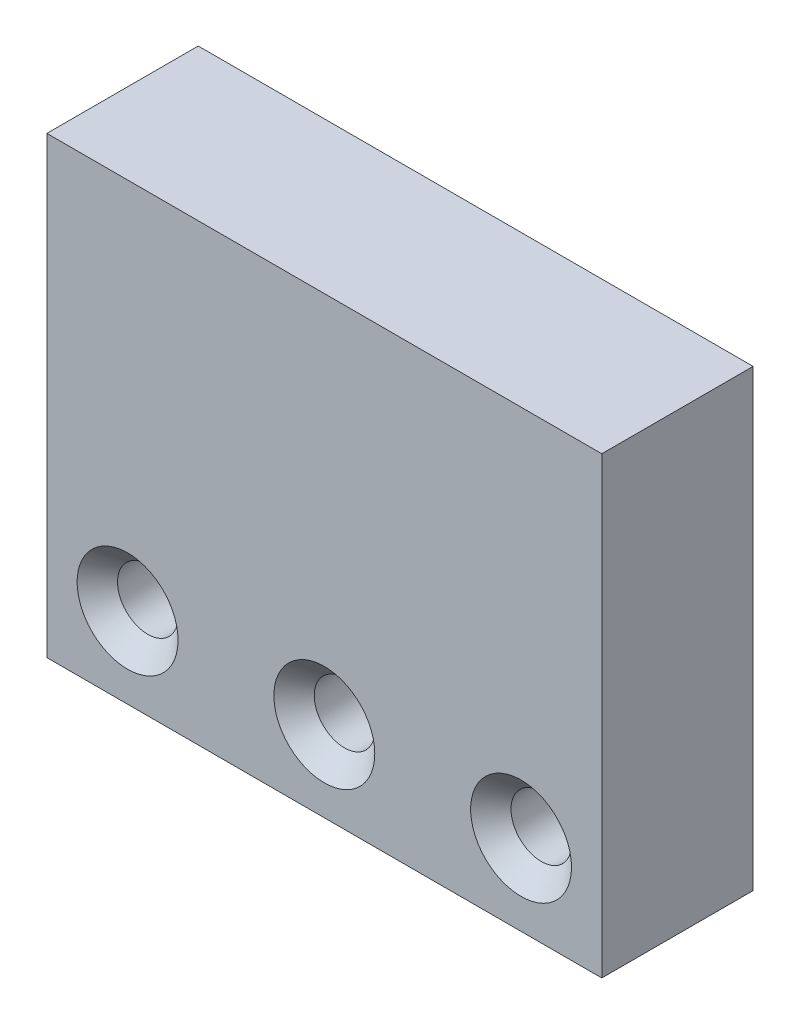
ISO-10303-21;
HEADER;
FILE_DESCRIPTION(('STEP AP214'),'2;1');
FILE_NAME('part.step','',(''),(''),'','','');
FILE_SCHEMA(('AUTOMOTIVE_DESIGN { 1 0 10303 214 1 1 1 1 }'));
ENDSEC;
DATA;
#1=APPLICATION_CONTEXT('core data for automotive mechanical design processes');
#2=APPLICATION_PROTOCOL_DEFINITION('international standard','automotive_design',2000,#1);
#3=PRODUCT_CONTEXT('',#1,'mechanical');
#4=PRODUCT('Part','Part','',(#3));
#5=PRODUCT_RELATED_PRODUCT_CATEGORY('part','',(#4));
#6=PRODUCT_DEFINITION_FORMATION('','',#4);
#7=PRODUCT_DEFINITION_CONTEXT('part definition',#1,'design');
#8=PRODUCT_DEFINITION('design','',#6,#7);
#9=PRODUCT_DEFINITION_SHAPE('','',#8);
#10=(LENGTH_UNIT() NAMED_UNIT(*) SI_UNIT(.MILLI.,.METRE.));
#11=(NAMED_UNIT(*) PLANE_ANGLE_UNIT() SI_UNIT($,.RADIAN.));
#12=(NAMED_UNIT(*) SI_UNIT($,.STERADIAN.) SOLID_ANGLE_UNIT());
#13=UNCERTAINTY_MEASURE_WITH_UNIT(LENGTH_MEASURE(1.E-05),#10,'distance_accuracy_value','');
#14=(GEOMETRIC_REPRESENTATION_CONTEXT(3) GLOBAL_UNCERTAINTY_ASSIGNED_CONTEXT((#13)) GLOBAL_UNIT_ASSIGNED_CONTEXT((#10,
#11,#12)) REPRESENTATION_CONTEXT('',''));
#15=CARTESIAN_POINT('',(0.,0.,0.));
#16=DIRECTION('',(0.,0.,1.));
#17=DIRECTION('',(1.,0.,0.));
#18=AXIS2_PLACEMENT_3D('',#15,#16,#17);
#19=CARTESIAN_POINT('',(0.,0.,7.5));
#20=DIRECTION('',(1.,0.,0.));
#21=DIRECTION('',(0.,0.,-1.));
#22=AXIS2_PLACEMENT_3D('',#19,#20,#21);
#23=PLANE('',#22);
#24=DIRECTION('',(0.,-1.,0.));
#25=VECTOR('',#24,1.);
#26=CARTESIAN_POINT('',(0.,0.,-7.5));
#27=LINE('',#26,#25);
#28=CARTESIAN_POINT('',(0.,45.,-7.5));
#29=VERTEX_POINT('',#28);
#30=CARTESIAN_POINT('',(0.,0.,-7.5));
#31=VERTEX_POINT('',#30);
#32=EDGE_CURVE('E155',#29,#31,#27,.T.);
#33=ORIENTED_EDGE('',*,*,#32,.T.);
#34=DIRECTION('',(0.,0.,-1.));
#35=VECTOR('',#34,1.);
#36=CARTESIAN_POINT('',(0.,0.,7.5));
#37=LINE('',#36,#35);
#38=CARTESIAN_POINT('',(0.,0.,7.5));
#39=VERTEX_POINT('',#38);
#40=EDGE_CURVE('E11',#39,#31,#37,.T.);
#41=ORIENTED_EDGE('',*,*,#40,.F.);
#42=DIRECTION('',(0.,-1.,0.));
#43=VECTOR('',#42,1.);
#44=CARTESIAN_POINT('',(0.,0.,7.5));
#45=LINE('',#44,#43);
#46=CARTESIAN_POINT('',(0.,45.,7.5));
#47=VERTEX_POINT('',#46);
#48=EDGE_CURVE('E156',#47,#39,#45,.T.);
#49=ORIENTED_EDGE('',*,*,#48,.F.);
#50=DIRECTION('',(0.,0.,-1.));
#51=VECTOR('',#50,1.);
#52=CARTESIAN_POINT('',(0.,45.,7.5));
#53=LINE('',#52,#51);
#54=EDGE_CURVE('E166',#47,#29,#53,.T.);
#55=ORIENTED_EDGE('',*,*,#54,.T.);
#56=EDGE_LOOP('',(#33,#41,#49,#55));
#57=FACE_BOUND('',#56,.T.);
#58=ADVANCED_FACE('F38',(#57),#23,.F.);
#59=CARTESIAN_POINT('',(0.,0.,7.5));
#60=DIRECTION('',(0.,1.,0.));
#61=DIRECTION('',(0.,0.,1.));
#62=AXIS2_PLACEMENT_3D('',#59,#60,#61);
#63=PLANE('',#62);
#64=DIRECTION('',(1.,0.,0.));
#65=VECTOR('',#64,1.);
#66=CARTESIAN_POINT('',(0.,0.,-7.5));
#67=LINE('',#66,#65);
#68=CARTESIAN_POINT('',(55.,0.,-7.5));
#69=VERTEX_POINT('',#68);
#70=EDGE_CURVE('E170',#31,#69,#67,.T.);
#71=ORIENTED_EDGE('',*,*,#70,.T.);
#72=DIRECTION('',(0.,0.,-1.));
#73=VECTOR('',#72,1.);
#74=CARTESIAN_POINT('',(55.,0.,7.5));
#75=LINE('',#74,#73);
#76=CARTESIAN_POINT('',(55.,0.,7.5));
#77=VERTEX_POINT('',#76);
#78=EDGE_CURVE('E47',#77,#69,#75,.T.);
#79=ORIENTED_EDGE('',*,*,#78,.F.);
#80=DIRECTION('',(1.,0.,0.));
#81=VECTOR('',#80,1.);
#82=CARTESIAN_POINT('',(0.,0.,7.5));
#83=LINE('',#82,#81);
#84=EDGE_CURVE('E86',#39,#77,#83,.T.);
#85=ORIENTED_EDGE('',*,*,#84,.F.);
#86=ORIENTED_EDGE('',*,*,#40,.T.);
#87=EDGE_LOOP('',(#71,#79,#85,#86));
#88=FACE_BOUND('',#87,.T.);
#89=ADVANCED_FACE('F201',(#88),#63,.F.);
#90=CARTESIAN_POINT('',(55.,0.,7.5));
#91=DIRECTION('',(-1.,0.,0.));
#92=DIRECTION('',(0.,0.,1.));
#93=AXIS2_PLACEMENT_3D('',#90,#91,#92);
#94=PLANE('',#93);
#95=DIRECTION('',(0.,1.,0.));
#96=VECTOR('',#95,1.);
#97=CARTESIAN_POINT('',(55.,0.,-7.5));
#98=LINE('',#97,#96);
#99=CARTESIAN_POINT('',(55.,45.,-7.5));
#100=VERTEX_POINT('',#99);
#101=EDGE_CURVE('E73',#69,#100,#98,.T.);
#102=ORIENTED_EDGE('',*,*,#101,.T.);
#103=DIRECTION('',(0.,0.,-1.));
#104=VECTOR('',#103,1.);
#105=CARTESIAN_POINT('',(55.,45.,7.5));
#106=LINE('',#105,#104);
#107=CARTESIAN_POINT('',(55.,45.,7.5));
#108=VERTEX_POINT('',#107);
#109=EDGE_CURVE('E179',#108,#100,#106,.T.);
#110=ORIENTED_EDGE('',*,*,#109,.F.);
#111=DIRECTION('',(0.,1.,0.));
#112=VECTOR('',#111,1.);
#113=CARTESIAN_POINT('',(55.,0.,7.5));
#114=LINE('',#113,#112);
#115=EDGE_CURVE('E161',#77,#108,#114,.T.);
#116=ORIENTED_EDGE('',*,*,#115,.F.);
#117=ORIENTED_EDGE('',*,*,#78,.T.);
#118=EDGE_LOOP('',(#102,#110,#116,#117));
#119=FACE_BOUND('',#118,.T.);
#120=ADVANCED_FACE('F184',(#119),#94,.F.);
#121=CARTESIAN_POINT('',(0.,45.,7.5));
#122=DIRECTION('',(0.,-1.,0.));
#123=DIRECTION('',(0.,0.,-1.));
#124=AXIS2_PLACEMENT_3D('',#121,#122,#123);
#125=PLANE('',#124);
#126=DIRECTION('',(-1.,0.,0.));
#127=VECTOR('',#126,1.);
#128=CARTESIAN_POINT('',(0.,45.,-7.5));
#129=LINE('',#128,#127);
#130=EDGE_CURVE('E79',#100,#29,#129,.T.);
#131=ORIENTED_EDGE('',*,*,#130,.T.);
#132=ORIENTED_EDGE('',*,*,#54,.F.);
#133=DIRECTION('',(-1.,0.,0.));
#134=VECTOR('',#133,1.);
#135=CARTESIAN_POINT('',(0.,45.,7.5));
#136=LINE('',#135,#134);
#137=EDGE_CURVE('E55',#108,#47,#136,.T.);
#138=ORIENTED_EDGE('',*,*,#137,.F.);
#139=ORIENTED_EDGE('',*,*,#109,.T.);
#140=EDGE_LOOP('',(#131,#132,#138,#139));
#141=FACE_BOUND('',#140,.T.);
#142=ADVANCED_FACE('F191',(#141),#125,.F.);
#143=CARTESIAN_POINT('',(0.,0.,7.5));
#144=DIRECTION('',(0.,0.,-1.));
#145=DIRECTION('',(-1.,0.,0.));
#146=AXIS2_PLACEMENT_3D('',#143,#144,#145);
#147=PLANE('',#146);
#148=CARTESIAN_POINT('',(8.,8.,7.5));
#149=DIRECTION('',(0.,0.,1.));
#150=DIRECTION('',(1.,0.,0.));
#151=AXIS2_PLACEMENT_3D('',#148,#149,#150);
#152=CIRCLE('',#151,5.);
#153=CARTESIAN_POINT('',(13.,8.,7.5));
#154=VERTEX_POINT('',#153);
#155=EDGE_CURVE('E119',#154,#154,#152,.T.);
#156=ORIENTED_EDGE('',*,*,#155,.F.);
#157=EDGE_LOOP('',(#156));
#158=FACE_BOUND('',#157,.T.);
#159=CARTESIAN_POINT('',(27.5,8.,7.5));
#160=DIRECTION('',(0.,0.,1.));
#161=DIRECTION('',(1.,0.,0.));
#162=AXIS2_PLACEMENT_3D('',#159,#160,#161);
#163=CIRCLE('',#162,5.);
#164=CARTESIAN_POINT('',(32.5,8.,7.5));
#165=VERTEX_POINT('',#164);
#166=EDGE_CURVE('E131',#165,#165,#163,.T.);
#167=ORIENTED_EDGE('',*,*,#166,.F.);
#168=EDGE_LOOP('',(#167));
#169=FACE_BOUND('',#168,.T.);
#170=CARTESIAN_POINT('',(47.,8.,7.5));
#171=DIRECTION('',(0.,0.,1.));
#172=DIRECTION('',(1.,0.,0.));
#173=AXIS2_PLACEMENT_3D('',#170,#171,#172);
#174=CIRCLE('',#173,5.);
#175=CARTESIAN_POINT('',(52.,8.,7.5));
#176=VERTEX_POINT('',#175);
#177=EDGE_CURVE('E143',#176,#176,#174,.T.);
#178=ORIENTED_EDGE('',*,*,#177,.F.);
#179=EDGE_LOOP('',(#178));
#180=FACE_BOUND('',#179,.T.);
#181=ORIENTED_EDGE('',*,*,#48,.T.);
#182=ORIENTED_EDGE('',*,*,#84,.T.);
#183=ORIENTED_EDGE('',*,*,#115,.T.);
#184=ORIENTED_EDGE('',*,*,#137,.T.);
#185=EDGE_LOOP('',(#181,#182,#183,#184));
#186=FACE_BOUND('',#185,.T.);
#187=ADVANCED_FACE('F193',(#158,#169,#180,#186),#147,.F.);
#188=CARTESIAN_POINT('',(0.,0.,-7.5));
#189=DIRECTION('',(0.,0.,-1.));
#190=DIRECTION('',(-1.,0.,0.));
#191=AXIS2_PLACEMENT_3D('',#188,#189,#190);
#192=PLANE('',#191);
#193=CARTESIAN_POINT('',(45.,36.,-7.5));
#194=DIRECTION('',(0.,0.,-1.));
#195=DIRECTION('',(-1.,0.,0.));
#196=AXIS2_PLACEMENT_3D('',#193,#194,#195);
#197=CIRCLE('',#196,2.1);
#198=CARTESIAN_POINT('',(42.9,36.,-7.5));
#199=VERTEX_POINT('',#198);
#200=EDGE_CURVE('E105',#199,#199,#197,.T.);
#201=ORIENTED_EDGE('',*,*,#200,.F.);
#202=EDGE_LOOP('',(#201));
#203=FACE_BOUND('',#202,.T.);
#204=CARTESIAN_POINT('',(10.,36.,-7.5));
#205=DIRECTION('',(0.,0.,-1.));
#206=DIRECTION('',(-1.,0.,0.));
#207=AXIS2_PLACEMENT_3D('',#204,#205,#206);
#208=CIRCLE('',#207,2.1);
#209=CARTESIAN_POINT('',(7.9,36.,-7.5));
#210=VERTEX_POINT('',#209);
#211=EDGE_CURVE('E104',#210,#210,#208,.T.);
#212=ORIENTED_EDGE('',*,*,#211,.F.);
#213=EDGE_LOOP('',(#212));
#214=FACE_BOUND('',#213,.T.);
#215=CARTESIAN_POINT('',(8.,8.,-7.50000000000001));
#216=DIRECTION('',(0.,0.,1.));
#217=DIRECTION('',(1.,0.,0.));
#218=AXIS2_PLACEMENT_3D('',#215,#216,#217);
#219=CIRCLE('',#218,2.99999999999996);
#220=CARTESIAN_POINT('',(11.,8.,-7.50000000000001));
#221=VERTEX_POINT('',#220);
#222=EDGE_CURVE('E127',#221,#221,#219,.T.);
#223=ORIENTED_EDGE('',*,*,#222,.T.);
#224=EDGE_LOOP('',(#223));
#225=FACE_BOUND('',#224,.T.);
#226=CARTESIAN_POINT('',(27.5,8.,-7.50000000000001));
#227=DIRECTION('',(0.,0.,1.));
#228=DIRECTION('',(1.,0.,0.));
#229=AXIS2_PLACEMENT_3D('',#226,#227,#228);
#230=CIRCLE('',#229,2.99999999999996);
#231=CARTESIAN_POINT('',(30.5,8.,-7.50000000000001));
#232=VERTEX_POINT('',#231);
#233=EDGE_CURVE('E139',#232,#232,#230,.T.);
#234=ORIENTED_EDGE('',*,*,#233,.T.);
#235=EDGE_LOOP('',(#234));
#236=FACE_BOUND('',#235,.T.);
#237=CARTESIAN_POINT('',(47.,8.,-7.50000000000001));
#238=DIRECTION('',(0.,0.,1.));
#239=DIRECTION('',(1.,0.,0.));
#240=AXIS2_PLACEMENT_3D('',#237,#238,#239);
#241=CIRCLE('',#240,2.99999999999996);
#242=CARTESIAN_POINT('',(50.,8.,-7.50000000000001));
#243=VERTEX_POINT('',#242);
#244=EDGE_CURVE('E151',#243,#243,#241,.T.);
#245=ORIENTED_EDGE('',*,*,#244,.T.);
#246=EDGE_LOOP('',(#245));
#247=FACE_BOUND('',#246,.T.);
#248=ORIENTED_EDGE('',*,*,#32,.F.);
#249=ORIENTED_EDGE('',*,*,#130,.F.);
#250=ORIENTED_EDGE('',*,*,#101,.F.);
#251=ORIENTED_EDGE('',*,*,#70,.F.);
#252=EDGE_LOOP('',(#248,#249,#250,#251));
#253=FACE_BOUND('',#252,.T.);
#254=ADVANCED_FACE('F187',(#203,#214,#225,#236,#247,#253),#192,.T.);
#255=CARTESIAN_POINT('',(47.,8.,7.5));
#256=DIRECTION('',(0.,0.,1.));
#257=DIRECTION('',(1.,0.,0.));
#258=AXIS2_PLACEMENT_3D('',#255,#256,#257);
#259=CYLINDRICAL_SURFACE('',#258,2.99999999999996);
#260=ORIENTED_EDGE('',*,*,#244,.F.);
#261=EDGE_LOOP('',(#260));
#262=FACE_BOUND('',#261,.T.);
#263=CARTESIAN_POINT('',(47.,8.,5.5));
#264=DIRECTION('',(0.,0.,1.));
#265=DIRECTION('',(1.,0.,0.));
#266=AXIS2_PLACEMENT_3D('',#263,#264,#265);
#267=CIRCLE('',#266,2.99999999999997);
#268=CARTESIAN_POINT('',(50.,8.,5.5));
#269=VERTEX_POINT('',#268);
#270=EDGE_CURVE('E147',#269,#269,#267,.T.);
#271=ORIENTED_EDGE('',*,*,#270,.T.);
#272=EDGE_LOOP('',(#271));
#273=FACE_BOUND('',#272,.T.);
#274=ADVANCED_FACE('F234',(#262,#273),#259,.F.);
#275=CARTESIAN_POINT('',(47.,8.,7.5));
#276=DIRECTION('',(0.,0.,1.));
#277=DIRECTION('',(1.,0.,0.));
#278=AXIS2_PLACEMENT_3D('',#275,#276,#277);
#279=CONICAL_SURFACE('',#278,5.,0.785398163397455);
#280=ORIENTED_EDGE('',*,*,#270,.F.);
#281=EDGE_LOOP('',(#280));
#282=FACE_BOUND('',#281,.T.);
#283=ORIENTED_EDGE('',*,*,#177,.T.);
#284=EDGE_LOOP('',(#283));
#285=FACE_BOUND('',#284,.T.);
#286=ADVANCED_FACE('F244',(#282,#285),#279,.F.);
#287=CARTESIAN_POINT('',(27.5,8.,7.5));
#288=DIRECTION('',(0.,0.,1.));
#289=DIRECTION('',(1.,0.,0.));
#290=AXIS2_PLACEMENT_3D('',#287,#288,#289);
#291=CYLINDRICAL_SURFACE('',#290,2.99999999999996);
#292=ORIENTED_EDGE('',*,*,#233,.F.);
#293=EDGE_LOOP('',(#292));
#294=FACE_BOUND('',#293,.T.);
#295=CARTESIAN_POINT('',(27.5,8.,5.5));
#296=DIRECTION('',(0.,0.,1.));
#297=DIRECTION('',(1.,0.,0.));
#298=AXIS2_PLACEMENT_3D('',#295,#296,#297);
#299=CIRCLE('',#298,2.99999999999996);
#300=CARTESIAN_POINT('',(30.5,8.,5.5));
#301=VERTEX_POINT('',#300);
#302=EDGE_CURVE('E135',#301,#301,#299,.T.);
#303=ORIENTED_EDGE('',*,*,#302,.T.);
#304=EDGE_LOOP('',(#303));
#305=FACE_BOUND('',#304,.T.);
#306=ADVANCED_FACE('F254',(#294,#305),#291,.F.);
#307=CARTESIAN_POINT('',(27.5,8.,7.5));
#308=DIRECTION('',(0.,0.,1.));
#309=DIRECTION('',(1.,0.,0.));
#310=AXIS2_PLACEMENT_3D('',#307,#308,#309);
#311=CONICAL_SURFACE('',#310,5.,0.785398163397457);
#312=ORIENTED_EDGE('',*,*,#302,.F.);
#313=EDGE_LOOP('',(#312));
#314=FACE_BOUND('',#313,.T.);
#315=ORIENTED_EDGE('',*,*,#166,.T.);
#316=EDGE_LOOP('',(#315));
#317=FACE_BOUND('',#316,.T.);
#318=ADVANCED_FACE('F264',(#314,#317),#311,.F.);
#319=CARTESIAN_POINT('',(8.,8.,7.5));
#320=DIRECTION('',(0.,0.,1.));
#321=DIRECTION('',(1.,0.,0.));
#322=AXIS2_PLACEMENT_3D('',#319,#320,#321);
#323=CYLINDRICAL_SURFACE('',#322,2.99999999999997);
#324=ORIENTED_EDGE('',*,*,#222,.F.);
#325=EDGE_LOOP('',(#324));
#326=FACE_BOUND('',#325,.T.);
#327=CARTESIAN_POINT('',(8.,8.,5.5));
#328=DIRECTION('',(0.,0.,1.));
#329=DIRECTION('',(1.,0.,0.));
#330=AXIS2_PLACEMENT_3D('',#327,#328,#329);
#331=CIRCLE('',#330,2.99999999999997);
#332=CARTESIAN_POINT('',(11.,8.,5.5));
#333=VERTEX_POINT('',#332);
#334=EDGE_CURVE('E123',#333,#333,#331,.T.);
#335=ORIENTED_EDGE('',*,*,#334,.T.);
#336=EDGE_LOOP('',(#335));
#337=FACE_BOUND('',#336,.T.);
#338=ADVANCED_FACE('F274',(#326,#337),#323,.F.);
#339=CARTESIAN_POINT('',(8.,8.,7.5));
#340=DIRECTION('',(0.,0.,1.));
#341=DIRECTION('',(1.,0.,0.));
#342=AXIS2_PLACEMENT_3D('',#339,#340,#341);
#343=CONICAL_SURFACE('',#342,5.,0.785398163397456);
#344=ORIENTED_EDGE('',*,*,#334,.F.);
#345=EDGE_LOOP('',(#344));
#346=FACE_BOUND('',#345,.T.);
#347=ORIENTED_EDGE('',*,*,#155,.T.);
#348=EDGE_LOOP('',(#347));
#349=FACE_BOUND('',#348,.T.);
#350=ADVANCED_FACE('F284',(#346,#349),#343,.F.);
#351=CARTESIAN_POINT('',(10.,36.,2.5));
#352=DIRECTION('',(0.,0.,-1.));
#353=DIRECTION('',(-1.,0.,0.));
#354=AXIS2_PLACEMENT_3D('',#351,#352,#353);
#355=CONICAL_SURFACE('',#354,2.1,1.02974425867665);
#356=CARTESIAN_POINT('',(9.99999999999999,36.,3.76180729995788));
#357=VERTEX_POINT('',#356);
#358=VERTEX_LOOP('',#357);
#359=FACE_BOUND('',#358,.T.);
#360=CARTESIAN_POINT('',(10.,36.,2.5));
#361=DIRECTION('',(0.,0.,-1.));
#362=DIRECTION('',(-1.,0.,0.));
#363=AXIS2_PLACEMENT_3D('',#360,#361,#362);
#364=CIRCLE('',#363,2.1);
#365=CARTESIAN_POINT('',(7.9,36.,2.5));
#366=VERTEX_POINT('',#365);
#367=EDGE_CURVE('E111',#366,#366,#364,.T.);
#368=ORIENTED_EDGE('',*,*,#367,.T.);
#369=EDGE_LOOP('',(#368));
#370=FACE_BOUND('',#369,.T.);
#371=ADVANCED_FACE('F293',(#359,#370),#355,.F.);
#372=CARTESIAN_POINT('',(10.,36.,-7.5));
#373=DIRECTION('',(0.,0.,-1.));
#374=DIRECTION('',(-1.,0.,0.));
#375=AXIS2_PLACEMENT_3D('',#372,#373,#374);
#376=CYLINDRICAL_SURFACE('',#375,2.1);
#377=ORIENTED_EDGE('',*,*,#367,.F.);
#378=EDGE_LOOP('',(#377));
#379=FACE_BOUND('',#378,.T.);
#380=ORIENTED_EDGE('',*,*,#211,.T.);
#381=EDGE_LOOP('',(#380));
#382=FACE_BOUND('',#381,.T.);
#383=ADVANCED_FACE('F97',(#379,#382),#376,.F.);
#384=CARTESIAN_POINT('',(45.,36.,2.5));
#385=DIRECTION('',(0.,0.,-1.));
#386=DIRECTION('',(-1.,0.,0.));
#387=AXIS2_PLACEMENT_3D('',#384,#385,#386);
#388=CONICAL_SURFACE('',#387,2.1,1.02974425867665);
#389=CARTESIAN_POINT('',(45.,36.,3.76180729995788));
#390=VERTEX_POINT('',#389);
#391=VERTEX_LOOP('',#390);
#392=FACE_BOUND('',#391,.T.);
#393=CARTESIAN_POINT('',(45.,36.,2.5));
#394=DIRECTION('',(0.,0.,-1.));
#395=DIRECTION('',(-1.,0.,0.));
#396=AXIS2_PLACEMENT_3D('',#393,#394,#395);
#397=CIRCLE('',#396,2.1);
#398=CARTESIAN_POINT('',(42.9,36.,2.5));
#399=VERTEX_POINT('',#398);
#400=EDGE_CURVE('E101',#399,#399,#397,.T.);
#401=ORIENTED_EDGE('',*,*,#400,.T.);
#402=EDGE_LOOP('',(#401));
#403=FACE_BOUND('',#402,.T.);
#404=ADVANCED_FACE('F93',(#392,#403),#388,.F.);
#405=CARTESIAN_POINT('',(45.,36.,-7.5));
#406=DIRECTION('',(0.,0.,-1.));
#407=DIRECTION('',(-1.,0.,0.));
#408=AXIS2_PLACEMENT_3D('',#405,#406,#407);
#409=CYLINDRICAL_SURFACE('',#408,2.1);
#410=ORIENTED_EDGE('',*,*,#400,.F.);
#411=EDGE_LOOP('',(#410));
#412=FACE_BOUND('',#411,.T.);
#413=ORIENTED_EDGE('',*,*,#200,.T.);
#414=EDGE_LOOP('',(#413));
#415=FACE_BOUND('',#414,.T.);
#416=ADVANCED_FACE('F96',(#412,#415),#409,.F.);
#417=CLOSED_SHELL('',(#58,#89,#120,#142,#187,#254,#274,#286,#306,#318,#338,#350,#371,#383,#404,#416));
#418=MANIFOLD_SOLID_BREP('B2',#417);
#419=ADVANCED_BREP_SHAPE_REPRESENTATION('',(#18,#418),#14);
#420=SHAPE_DEFINITION_REPRESENTATION(#9,#419);
ENDSEC;
END-ISO-10303-21;
